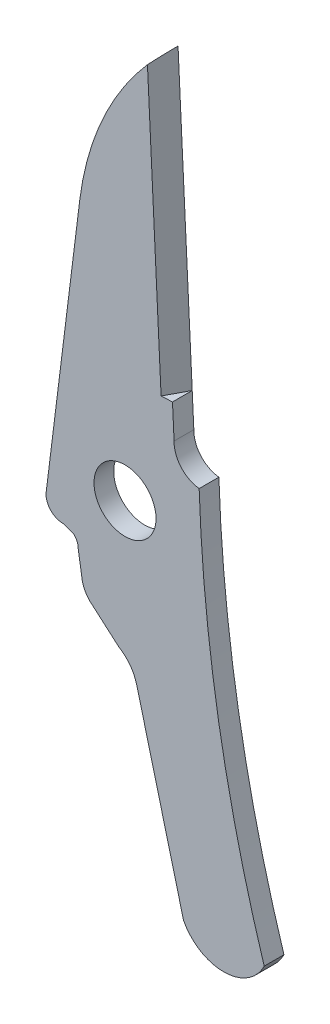
ISO-10303-21;
HEADER;
FILE_DESCRIPTION(('STEP AP214'),'2;1');
FILE_NAME('part.step','',(''),(''),'','','');
FILE_SCHEMA(('AUTOMOTIVE_DESIGN { 1 0 10303 214 1 1 1 1 }'));
ENDSEC;
DATA;
#1=APPLICATION_CONTEXT('core data for automotive mechanical design processes');
#2=APPLICATION_PROTOCOL_DEFINITION('international standard','automotive_design',2000,#1);
#3=PRODUCT_CONTEXT('',#1,'mechanical');
#4=PRODUCT('Part','Part','',(#3));
#5=PRODUCT_RELATED_PRODUCT_CATEGORY('part','',(#4));
#6=PRODUCT_DEFINITION_FORMATION('','',#4);
#7=PRODUCT_DEFINITION_CONTEXT('part definition',#1,'design');
#8=PRODUCT_DEFINITION('design','',#6,#7);
#9=PRODUCT_DEFINITION_SHAPE('','',#8);
#10=(LENGTH_UNIT() NAMED_UNIT(*) SI_UNIT(.MILLI.,.METRE.));
#11=(NAMED_UNIT(*) PLANE_ANGLE_UNIT() SI_UNIT($,.RADIAN.));
#12=(NAMED_UNIT(*) SI_UNIT($,.STERADIAN.) SOLID_ANGLE_UNIT());
#13=UNCERTAINTY_MEASURE_WITH_UNIT(LENGTH_MEASURE(1.E-05),#10,'distance_accuracy_value','');
#14=(GEOMETRIC_REPRESENTATION_CONTEXT(3) GLOBAL_UNCERTAINTY_ASSIGNED_CONTEXT((#13)) GLOBAL_UNIT_ASSIGNED_CONTEXT((#10,
#11,#12)) REPRESENTATION_CONTEXT('',''));
#15=CARTESIAN_POINT('',(0.,0.,0.));
#16=DIRECTION('',(0.,0.,1.));
#17=DIRECTION('',(1.,0.,0.));
#18=AXIS2_PLACEMENT_3D('',#15,#16,#17);
#19=CARTESIAN_POINT('',(9.00284972026528,22.726912505166,0.4445));
#20=DIRECTION('',(-0.998816471160994,-0.048638019465231,0.));
#21=DIRECTION('',(0.048638019465231,-0.998816471160993,0.));
#22=AXIS2_PLACEMENT_3D('',#19,#20,#21);
#23=PLANE('',#22);
#24=DIRECTION('',(0.,0.,-1.));
#25=VECTOR('',#24,1.);
#26=CARTESIAN_POINT('',(9.64159611899911,9.60979895973924,-0.4445));
#27=LINE('',#26,#25);
#28=CARTESIAN_POINT('',(9.64159611899911,9.60979895973925,0.4445));
#29=VERTEX_POINT('',#28);
#30=CARTESIAN_POINT('',(9.64159611899911,9.60979895973924,-0.4445));
#31=VERTEX_POINT('',#30);
#32=EDGE_CURVE('E331',#29,#31,#27,.T.);
#33=ORIENTED_EDGE('',*,*,#32,.F.);
#34=DIRECTION('',(-0.048638019465231,0.998816471160994,0.));
#35=VECTOR('',#34,1.);
#36=CARTESIAN_POINT('',(9.00284972026528,22.726912505166,0.4445));
#37=LINE('',#36,#35);
#38=CARTESIAN_POINT('',(9.71404972026528,8.12191250516599,0.4445));
#39=VERTEX_POINT('',#38);
#40=EDGE_CURVE('E180',#39,#29,#37,.T.);
#41=ORIENTED_EDGE('',*,*,#40,.F.);
#42=DIRECTION('',(0.,0.,-1.));
#43=VECTOR('',#42,1.);
#44=CARTESIAN_POINT('',(9.71404972026528,8.12191250516599,0.4445));
#45=LINE('',#44,#43);
#46=CARTESIAN_POINT('',(9.71404972026528,8.12191250516599,-0.4445));
#47=VERTEX_POINT('',#46);
#48=EDGE_CURVE('E186',#39,#47,#45,.T.);
#49=ORIENTED_EDGE('',*,*,#48,.T.);
#50=DIRECTION('',(-0.048638019465231,0.998816471160994,0.));
#51=VECTOR('',#50,1.);
#52=CARTESIAN_POINT('',(9.00284972026528,22.726912505166,-0.4445));
#53=LINE('',#52,#51);
#54=EDGE_CURVE('E226',#47,#31,#53,.T.);
#55=ORIENTED_EDGE('',*,*,#54,.T.);
#56=EDGE_LOOP('',(#33,#41,#49,#55));
#57=FACE_BOUND('',#56,.T.);
#58=ADVANCED_FACE('F38',(#57),#23,.F.);
#59=CARTESIAN_POINT('',(18.0703507512172,13.8347572515908,0.4445));
#60=DIRECTION('',(0.,0.,1.));
#61=DIRECTION('',(1.,0.,0.));
#62=AXIS2_PLACEMENT_3D('',#59,#60,#61);
#63=PLANE('',#62);
#64=DIRECTION('',(-0.048638019465231,0.998816471160993,0.));
#65=VECTOR('',#64,1.);
#66=CARTESIAN_POINT('',(9.12893919289632,9.58483479638119,0.4445));
#67=LINE('',#66,#65);
#68=CARTESIAN_POINT('',(9.12893919289632,9.58483479638119,0.4445));
#69=VERTEX_POINT('',#68);
#70=CARTESIAN_POINT('',(8.51463268443419,22.2000577380142,0.4445));
#71=VERTEX_POINT('',#70);
#72=EDGE_CURVE('E335',#69,#71,#67,.T.);
#73=ORIENTED_EDGE('',*,*,#72,.T.);
#74=CARTESIAN_POINT('',(18.0703507512172,13.8347572515908,0.4445));
#75=DIRECTION('',(0.,0.,1.));
#76=DIRECTION('',(1.,0.,0.));
#77=AXIS2_PLACEMENT_3D('',#74,#75,#76);
#78=CIRCLE('',#77,12.7);
#79=CARTESIAN_POINT('',(5.46767149406671,15.4039849410572,0.4445));
#80=VERTEX_POINT('',#79);
#81=EDGE_CURVE('E119',#71,#80,#78,.T.);
#82=ORIENTED_EDGE('',*,*,#81,.T.);
#83=DIRECTION('',(-0.123561235391059,-0.99233694938193,0.));
#84=VECTOR('',#83,1.);
#85=CARTESIAN_POINT('',(5.46767149406671,15.4039849410572,0.4445));
#86=LINE('',#85,#84);
#87=CARTESIAN_POINT('',(3.96223046287007,3.3135849410572,0.4445));
#88=VERTEX_POINT('',#87);
#89=EDGE_CURVE('E366',#80,#88,#86,.T.);
#90=ORIENTED_EDGE('',*,*,#89,.T.);
#91=CARTESIAN_POINT('',(4.70995075121722,3.16675725159075,0.4445));
#92=DIRECTION('',(0.,0.,1.));
#93=DIRECTION('',(1.,0.,0.));
#94=AXIS2_PLACEMENT_3D('',#91,#92,#93);
#95=CIRCLE('',#94,0.762);
#96=CARTESIAN_POINT('',(4.70995075121722,2.40475725159075,0.4445));
#97=VERTEX_POINT('',#96);
#98=EDGE_CURVE('E272',#88,#97,#95,.T.);
#99=ORIENTED_EDGE('',*,*,#98,.T.);
#100=DIRECTION('',(0.944320023055618,-0.329028409193243,0.));
#101=VECTOR('',#100,1.);
#102=CARTESIAN_POINT('',(4.70995075121722,2.40475725159075,0.4445));
#103=LINE('',#102,#101);
#104=CARTESIAN_POINT('',(5.19255075121722,2.23660545304808,0.4445));
#105=VERTEX_POINT('',#104);
#106=EDGE_CURVE('E293',#97,#105,#103,.T.);
#107=ORIENTED_EDGE('',*,*,#106,.T.);
#108=CARTESIAN_POINT('',(4.76075075121722,1.76975725159075,0.4445));
#109=DIRECTION('',(0.,0.,-1.));
#110=DIRECTION('',(-1.,0.,0.));
#111=AXIS2_PLACEMENT_3D('',#108,#109,#110);
#112=CIRCLE('',#111,0.635923331231008);
#113=CARTESIAN_POINT('',(5.39667408244823,1.76975725159075,0.4445));
#114=VERTEX_POINT('',#113);
#115=EDGE_CURVE('E289',#105,#114,#112,.T.);
#116=ORIENTED_EDGE('',*,*,#115,.T.);
#117=DIRECTION('',(0.155122482766874,-0.987895245124826,0.));
#118=VECTOR('',#117,1.);
#119=CARTESIAN_POINT('',(5.39667408244823,1.76975725159075,0.4445));
#120=LINE('',#119,#118);
#121=CARTESIAN_POINT('',(5.55222127450851,0.779157251590754,0.4445));
#122=VERTEX_POINT('',#121);
#123=EDGE_CURVE('E292',#114,#122,#120,.T.);
#124=ORIENTED_EDGE('',*,*,#123,.T.);
#125=CARTESIAN_POINT('',(6.81815075121722,0.880757251590754,0.4445));
#126=DIRECTION('',(0.,0.,1.));
#127=DIRECTION('',(1.,0.,0.));
#128=AXIS2_PLACEMENT_3D('',#125,#126,#127);
#129=CIRCLE('',#128,1.27);
#130=CARTESIAN_POINT('',(6.05075596195179,-0.13117418749406,0.4445));
#131=VERTEX_POINT('',#130);
#132=EDGE_CURVE('E298',#122,#131,#129,.T.);
#133=ORIENTED_EDGE('',*,*,#132,.T.);
#134=DIRECTION('',(0.754605522163505,-0.656178714924787,0.));
#135=VECTOR('',#134,1.);
#136=CARTESIAN_POINT('',(6.05075596195179,-0.13117418749406,0.4445));
#137=LINE('',#136,#135);
#138=CARTESIAN_POINT('',(7.21915596195179,-1.14717418749406,0.4445));
#139=VERTEX_POINT('',#138);
#140=EDGE_CURVE('E305',#131,#139,#137,.T.);
#141=ORIENTED_EDGE('',*,*,#140,.T.);
#142=CARTESIAN_POINT('',(6.31015075121722,-2.67524274840925,0.4445));
#143=DIRECTION('',(0.,0.,-1.));
#144=DIRECTION('',(1.,0.,0.));
#145=AXIS2_PLACEMENT_3D('',#142,#143,#144);
#146=CIRCLE('',#145,1.778);
#147=CARTESIAN_POINT('',(8.03118123931657,-2.22876983878032,0.4445));
#148=VERTEX_POINT('',#147);
#149=EDGE_CURVE('E308',#139,#148,#146,.T.);
#150=ORIENTED_EDGE('',*,*,#149,.T.);
#151=DIRECTION('',(0.251109622963401,-0.967958654724043,0.));
#152=VECTOR('',#151,1.);
#153=CARTESIAN_POINT('',(8.03118123931657,-2.22876983878032,0.4445));
#154=LINE('',#153,#152);
#155=CARTESIAN_POINT('',(10.1397620195859,-10.3567698387803,0.4445));
#156=VERTEX_POINT('',#155);
#157=EDGE_CURVE('E158',#148,#156,#154,.T.);
#158=ORIENTED_EDGE('',*,*,#157,.T.);
#159=CARTESIAN_POINT('',(11.9489507512172,-9.43164274840925,0.4445));
#160=DIRECTION('',(0.,0.,1.));
#161=DIRECTION('',(-1.,0.,0.));
#162=AXIS2_PLACEMENT_3D('',#159,#160,#161);
#163=CIRCLE('',#162,2.03200000000001);
#164=CARTESIAN_POINT('',(13.772182249136,-10.3287775794112,0.4445));
#165=VERTEX_POINT('',#164);
#166=EDGE_CURVE('E150',#156,#165,#163,.T.);
#167=ORIENTED_EDGE('',*,*,#166,.T.);
#168=CARTESIAN_POINT('',(75.3219507512172,9.00875725159075,0.4445));
#169=DIRECTION('',(0.,0.,-1.));
#170=DIRECTION('',(1.,0.,0.));
#171=AXIS2_PLACEMENT_3D('',#168,#169,#170);
#172=CIRCLE('',#171,64.516);
#173=CARTESIAN_POINT('',(10.842675562061,6.83221708861181,0.4445));
#174=VERTEX_POINT('',#173);
#175=EDGE_CURVE('E155',#165,#174,#172,.T.);
#176=ORIENTED_EDGE('',*,*,#175,.T.);
#177=CARTESIAN_POINT('',(10.9837507512172,8.09435725159075,0.4445));
#178=DIRECTION('',(0.,0.,-1.));
#179=DIRECTION('',(1.,0.,0.));
#180=AXIS2_PLACEMENT_3D('',#177,#178,#179);
#181=CIRCLE('',#180,1.27);
#182=EDGE_CURVE('E63',#174,#39,#181,.T.);
#183=ORIENTED_EDGE('',*,*,#182,.T.);
#184=ORIENTED_EDGE('',*,*,#40,.T.);
#185=DIRECTION('',(0.998816471160993,0.0486380194652366,0.));
#186=VECTOR('',#185,1.);
#187=CARTESIAN_POINT('',(9.64159611899911,9.60979895973924,0.4445));
#188=LINE('',#187,#186);
#189=EDGE_CURVE('E54',#69,#29,#188,.T.);
#190=ORIENTED_EDGE('',*,*,#189,.F.);
#191=EDGE_LOOP('',(#73,#82,#90,#99,#107,#116,#124,#133,#141,#150,#158,#167,#176,#183,#184,#190));
#192=FACE_BOUND('',#191,.T.);
#193=CARTESIAN_POINT('',(7.50395075121722,4.69075725159075,0.4445));
#194=DIRECTION('',(0.,0.,1.));
#195=DIRECTION('',(1.,0.,0.));
#196=AXIS2_PLACEMENT_3D('',#193,#194,#195);
#197=CIRCLE('',#196,1.397);
#198=CARTESIAN_POINT('',(8.90095075121722,4.69075725159075,0.4445));
#199=VERTEX_POINT('',#198);
#200=EDGE_CURVE('E192',#199,#199,#197,.T.);
#201=ORIENTED_EDGE('',*,*,#200,.F.);
#202=EDGE_LOOP('',(#201));
#203=FACE_BOUND('',#202,.T.);
#204=ADVANCED_FACE('F152',(#192,#203),#63,.T.);
#205=CARTESIAN_POINT('',(18.0703507512172,13.8347572515908,-0.4445));
#206=DIRECTION('',(0.,0.,1.));
#207=DIRECTION('',(1.,0.,0.));
#208=AXIS2_PLACEMENT_3D('',#205,#206,#207);
#209=PLANE('',#208);
#210=CARTESIAN_POINT('',(18.0703507512172,13.8347572515908,-0.4445));
#211=DIRECTION('',(0.,0.,1.));
#212=DIRECTION('',(1.,0.,0.));
#213=AXIS2_PLACEMENT_3D('',#210,#211,#212);
#214=CIRCLE('',#213,12.7);
#215=CARTESIAN_POINT('',(9.00284972026528,22.726912505166,-0.4445));
#216=VERTEX_POINT('',#215);
#217=CARTESIAN_POINT('',(5.46767149406671,15.4039849410572,-0.4445));
#218=VERTEX_POINT('',#217);
#219=EDGE_CURVE('E187',#216,#218,#214,.T.);
#220=ORIENTED_EDGE('',*,*,#219,.F.);
#221=DIRECTION('',(-0.048638019465231,0.998816471160993,0.));
#222=VECTOR('',#221,1.);
#223=CARTESIAN_POINT('',(9.64159611899911,9.60979895973924,-0.4445));
#224=LINE('',#223,#222);
#225=EDGE_CURVE('E347',#31,#216,#224,.T.);
#226=ORIENTED_EDGE('',*,*,#225,.F.);
#227=ORIENTED_EDGE('',*,*,#54,.F.);
#228=CARTESIAN_POINT('',(10.9837507512172,8.09435725159075,-0.4445));
#229=DIRECTION('',(0.,0.,-1.));
#230=DIRECTION('',(1.,0.,0.));
#231=AXIS2_PLACEMENT_3D('',#228,#229,#230);
#232=CIRCLE('',#231,1.27);
#233=CARTESIAN_POINT('',(10.842675562061,6.83221708861181,-0.4445));
#234=VERTEX_POINT('',#233);
#235=EDGE_CURVE('E111',#234,#47,#232,.T.);
#236=ORIENTED_EDGE('',*,*,#235,.F.);
#237=CARTESIAN_POINT('',(75.3219507512172,9.00875725159075,-0.4445));
#238=DIRECTION('',(0.,0.,-1.));
#239=DIRECTION('',(1.,0.,0.));
#240=AXIS2_PLACEMENT_3D('',#237,#238,#239);
#241=CIRCLE('',#240,64.516);
#242=CARTESIAN_POINT('',(13.772182249136,-10.3287775794112,-0.4445));
#243=VERTEX_POINT('',#242);
#244=EDGE_CURVE('E221',#243,#234,#241,.T.);
#245=ORIENTED_EDGE('',*,*,#244,.F.);
#246=CARTESIAN_POINT('',(11.9489507512172,-9.43164274840925,-0.4445));
#247=DIRECTION('',(0.,0.,1.));
#248=DIRECTION('',(-1.,0.,0.));
#249=AXIS2_PLACEMENT_3D('',#246,#247,#248);
#250=CIRCLE('',#249,2.03200000000001);
#251=CARTESIAN_POINT('',(10.1397620195859,-10.3567698387803,-0.4445));
#252=VERTEX_POINT('',#251);
#253=EDGE_CURVE('E168',#252,#243,#250,.T.);
#254=ORIENTED_EDGE('',*,*,#253,.F.);
#255=DIRECTION('',(0.251109622963401,-0.967958654724043,0.));
#256=VECTOR('',#255,1.);
#257=CARTESIAN_POINT('',(8.03118123931657,-2.22876983878032,-0.4445));
#258=LINE('',#257,#256);
#259=CARTESIAN_POINT('',(8.03118123931657,-2.22876983878032,-0.4445));
#260=VERTEX_POINT('',#259);
#261=EDGE_CURVE('E216',#260,#252,#258,.T.);
#262=ORIENTED_EDGE('',*,*,#261,.F.);
#263=CARTESIAN_POINT('',(6.31015075121722,-2.67524274840925,-0.4445));
#264=DIRECTION('',(0.,0.,-1.));
#265=DIRECTION('',(1.,0.,0.));
#266=AXIS2_PLACEMENT_3D('',#263,#264,#265);
#267=CIRCLE('',#266,1.778);
#268=CARTESIAN_POINT('',(7.21915596195179,-1.14717418749406,-0.4445));
#269=VERTEX_POINT('',#268);
#270=EDGE_CURVE('E213',#269,#260,#267,.T.);
#271=ORIENTED_EDGE('',*,*,#270,.F.);
#272=DIRECTION('',(0.754605522163505,-0.656178714924787,0.));
#273=VECTOR('',#272,1.);
#274=CARTESIAN_POINT('',(6.05075596195179,-0.13117418749406,-0.4445));
#275=LINE('',#274,#273);
#276=CARTESIAN_POINT('',(6.05075596195179,-0.13117418749406,-0.4445));
#277=VERTEX_POINT('',#276);
#278=EDGE_CURVE('E210',#277,#269,#275,.T.);
#279=ORIENTED_EDGE('',*,*,#278,.F.);
#280=CARTESIAN_POINT('',(6.81815075121722,0.880757251590754,-0.4445));
#281=DIRECTION('',(0.,0.,1.));
#282=DIRECTION('',(1.,0.,0.));
#283=AXIS2_PLACEMENT_3D('',#280,#281,#282);
#284=CIRCLE('',#283,1.27);
#285=CARTESIAN_POINT('',(5.55222127450851,0.779157251590754,-0.4445));
#286=VERTEX_POINT('',#285);
#287=EDGE_CURVE('E207',#286,#277,#284,.T.);
#288=ORIENTED_EDGE('',*,*,#287,.F.);
#289=DIRECTION('',(0.155122482766874,-0.987895245124826,0.));
#290=VECTOR('',#289,1.);
#291=CARTESIAN_POINT('',(5.39667408244823,1.76975725159075,-0.4445));
#292=LINE('',#291,#290);
#293=CARTESIAN_POINT('',(5.39667408244823,1.76975725159075,-0.4445));
#294=VERTEX_POINT('',#293);
#295=EDGE_CURVE('E204',#294,#286,#292,.T.);
#296=ORIENTED_EDGE('',*,*,#295,.F.);
#297=CARTESIAN_POINT('',(4.76075075121722,1.76975725159075,-0.4445));
#298=DIRECTION('',(0.,0.,-1.));
#299=DIRECTION('',(-1.,0.,0.));
#300=AXIS2_PLACEMENT_3D('',#297,#298,#299);
#301=CIRCLE('',#300,0.635923331231008);
#302=CARTESIAN_POINT('',(5.19255075121722,2.23660545304808,-0.4445));
#303=VERTEX_POINT('',#302);
#304=EDGE_CURVE('E201',#303,#294,#301,.T.);
#305=ORIENTED_EDGE('',*,*,#304,.F.);
#306=DIRECTION('',(0.944320023055618,-0.329028409193243,0.));
#307=VECTOR('',#306,1.);
#308=CARTESIAN_POINT('',(4.70995075121722,2.40475725159075,-0.4445));
#309=LINE('',#308,#307);
#310=CARTESIAN_POINT('',(4.70995075121722,2.40475725159075,-0.4445));
#311=VERTEX_POINT('',#310);
#312=EDGE_CURVE('E198',#311,#303,#309,.T.);
#313=ORIENTED_EDGE('',*,*,#312,.F.);
#314=CARTESIAN_POINT('',(4.70995075121722,3.16675725159075,-0.4445));
#315=DIRECTION('',(0.,0.,1.));
#316=DIRECTION('',(1.,0.,0.));
#317=AXIS2_PLACEMENT_3D('',#314,#315,#316);
#318=CIRCLE('',#317,0.762);
#319=CARTESIAN_POINT('',(3.96223046287007,3.3135849410572,-0.4445));
#320=VERTEX_POINT('',#319);
#321=EDGE_CURVE('E195',#320,#311,#318,.T.);
#322=ORIENTED_EDGE('',*,*,#321,.F.);
#323=DIRECTION('',(-0.123561235391059,-0.99233694938193,0.));
#324=VECTOR('',#323,1.);
#325=CARTESIAN_POINT('',(5.46767149406671,15.4039849410572,-0.4445));
#326=LINE('',#325,#324);
#327=EDGE_CURVE('E191',#218,#320,#326,.T.);
#328=ORIENTED_EDGE('',*,*,#327,.F.);
#329=EDGE_LOOP('',(#220,#226,#227,#236,#245,#254,#262,#271,#279,#288,#296,#305,#313,#322,#328));
#330=FACE_BOUND('',#329,.T.);
#331=CARTESIAN_POINT('',(7.50395075121722,4.69075725159075,-0.4445));
#332=DIRECTION('',(0.,0.,1.));
#333=DIRECTION('',(1.,0.,0.));
#334=AXIS2_PLACEMENT_3D('',#331,#332,#333);
#335=CIRCLE('',#334,1.397);
#336=CARTESIAN_POINT('',(8.90095075121722,4.69075725159075,-0.4445));
#337=VERTEX_POINT('',#336);
#338=EDGE_CURVE('E357',#337,#337,#335,.T.);
#339=ORIENTED_EDGE('',*,*,#338,.T.);
#340=EDGE_LOOP('',(#339));
#341=FACE_BOUND('',#340,.T.);
#342=ADVANCED_FACE('F277',(#330,#341),#209,.F.);
#343=CARTESIAN_POINT('',(18.0703507512172,13.8347572515908,0.4445));
#344=DIRECTION('',(0.,0.,-1.));
#345=DIRECTION('',(-1.,0.,0.));
#346=AXIS2_PLACEMENT_3D('',#343,#344,#345);
#347=CYLINDRICAL_SURFACE('',#346,12.7);
#348=ORIENTED_EDGE('',*,*,#81,.F.);
#349=CARTESIAN_POINT('',(18.0703507512172,13.8347572515908,-15.3821782551398));
#350=DIRECTION('',(-0.865000437743751,-0.0421217604466522,-0.499999999999995));
#351=DIRECTION('',(0.499408235580491,0.0243190097326152,-0.866025403784442));
#352=AXIS2_PLACEMENT_3D('',#349,#350,#351);
#353=ELLIPSE('',#352,25.4000000000003,12.7);
#354=EDGE_CURVE('E351',#71,#216,#353,.T.);
#355=ORIENTED_EDGE('',*,*,#354,.T.);
#356=ORIENTED_EDGE('',*,*,#219,.T.);
#357=DIRECTION('',(0.,0.,-1.));
#358=VECTOR('',#357,1.);
#359=CARTESIAN_POINT('',(5.46767149406671,15.4039849410572,0.4445));
#360=LINE('',#359,#358);
#361=EDGE_CURVE('E11',#80,#218,#360,.T.);
#362=ORIENTED_EDGE('',*,*,#361,.F.);
#363=EDGE_LOOP('',(#348,#355,#356,#362));
#364=FACE_BOUND('',#363,.T.);
#365=ADVANCED_FACE('F40',(#364),#347,.T.);
#366=CARTESIAN_POINT('',(5.46767149406671,15.4039849410572,0.4445));
#367=DIRECTION('',(0.99233694938193,-0.123561235391059,0.));
#368=DIRECTION('',(0.123561235391059,0.99233694938193,0.));
#369=AXIS2_PLACEMENT_3D('',#366,#367,#368);
#370=PLANE('',#369);
#371=ORIENTED_EDGE('',*,*,#327,.T.);
#372=DIRECTION('',(0.,0.,-1.));
#373=VECTOR('',#372,1.);
#374=CARTESIAN_POINT('',(3.96223046287007,3.3135849410572,0.4445));
#375=LINE('',#374,#373);
#376=EDGE_CURVE('E47',#88,#320,#375,.T.);
#377=ORIENTED_EDGE('',*,*,#376,.F.);
#378=ORIENTED_EDGE('',*,*,#89,.F.);
#379=ORIENTED_EDGE('',*,*,#361,.T.);
#380=EDGE_LOOP('',(#371,#377,#378,#379));
#381=FACE_BOUND('',#380,.T.);
#382=ADVANCED_FACE('F371',(#381),#370,.F.);
#383=CARTESIAN_POINT('',(4.70995075121722,3.16675725159075,0.4445));
#384=DIRECTION('',(0.,0.,-1.));
#385=DIRECTION('',(-1.,0.,0.));
#386=AXIS2_PLACEMENT_3D('',#383,#384,#385);
#387=CYLINDRICAL_SURFACE('',#386,0.762);
#388=ORIENTED_EDGE('',*,*,#321,.T.);
#389=DIRECTION('',(0.,0.,-1.));
#390=VECTOR('',#389,1.);
#391=CARTESIAN_POINT('',(4.70995075121722,2.40475725159075,0.4445));
#392=LINE('',#391,#390);
#393=EDGE_CURVE('E260',#97,#311,#392,.T.);
#394=ORIENTED_EDGE('',*,*,#393,.F.);
#395=ORIENTED_EDGE('',*,*,#98,.F.);
#396=ORIENTED_EDGE('',*,*,#376,.T.);
#397=EDGE_LOOP('',(#388,#394,#395,#396));
#398=FACE_BOUND('',#397,.T.);
#399=ADVANCED_FACE('F270',(#398),#387,.T.);
#400=CARTESIAN_POINT('',(4.70995075121722,2.40475725159075,0.4445));
#401=DIRECTION('',(0.329028409193243,0.944320023055618,0.));
#402=DIRECTION('',(-0.944320023055618,0.329028409193243,0.));
#403=AXIS2_PLACEMENT_3D('',#400,#401,#402);
#404=PLANE('',#403);
#405=ORIENTED_EDGE('',*,*,#312,.T.);
#406=DIRECTION('',(0.,0.,-1.));
#407=VECTOR('',#406,1.);
#408=CARTESIAN_POINT('',(5.19255075121722,2.23660545304808,0.4445));
#409=LINE('',#408,#407);
#410=EDGE_CURVE('E256',#105,#303,#409,.T.);
#411=ORIENTED_EDGE('',*,*,#410,.F.);
#412=ORIENTED_EDGE('',*,*,#106,.F.);
#413=ORIENTED_EDGE('',*,*,#393,.T.);
#414=EDGE_LOOP('',(#405,#411,#412,#413));
#415=FACE_BOUND('',#414,.T.);
#416=ADVANCED_FACE('F283',(#415),#404,.F.);
#417=CARTESIAN_POINT('',(4.76075075121722,1.76975725159075,0.4445));
#418=DIRECTION('',(0.,0.,-1.));
#419=DIRECTION('',(-1.,0.,0.));
#420=AXIS2_PLACEMENT_3D('',#417,#418,#419);
#421=CYLINDRICAL_SURFACE('',#420,0.635923331231008);
#422=ORIENTED_EDGE('',*,*,#304,.T.);
#423=DIRECTION('',(0.,0.,-1.));
#424=VECTOR('',#423,1.);
#425=CARTESIAN_POINT('',(5.39667408244823,1.76975725159075,0.4445));
#426=LINE('',#425,#424);
#427=EDGE_CURVE('E252',#114,#294,#426,.T.);
#428=ORIENTED_EDGE('',*,*,#427,.F.);
#429=ORIENTED_EDGE('',*,*,#115,.F.);
#430=ORIENTED_EDGE('',*,*,#410,.T.);
#431=EDGE_LOOP('',(#422,#428,#429,#430));
#432=FACE_BOUND('',#431,.T.);
#433=ADVANCED_FACE('F287',(#432),#421,.F.);
#434=CARTESIAN_POINT('',(5.39667408244823,1.76975725159075,0.4445));
#435=DIRECTION('',(0.987895245124826,0.155122482766874,0.));
#436=DIRECTION('',(-0.155122482766874,0.987895245124827,0.));
#437=AXIS2_PLACEMENT_3D('',#434,#435,#436);
#438=PLANE('',#437);
#439=ORIENTED_EDGE('',*,*,#295,.T.);
#440=DIRECTION('',(0.,0.,-1.));
#441=VECTOR('',#440,1.);
#442=CARTESIAN_POINT('',(5.55222127450851,0.779157251590754,0.4445));
#443=LINE('',#442,#441);
#444=EDGE_CURVE('E248',#122,#286,#443,.T.);
#445=ORIENTED_EDGE('',*,*,#444,.F.);
#446=ORIENTED_EDGE('',*,*,#123,.F.);
#447=ORIENTED_EDGE('',*,*,#427,.T.);
#448=EDGE_LOOP('',(#439,#445,#446,#447));
#449=FACE_BOUND('',#448,.T.);
#450=ADVANCED_FACE('F412',(#449),#438,.F.);
#451=CARTESIAN_POINT('',(6.81815075121722,0.880757251590754,0.4445));
#452=DIRECTION('',(0.,0.,-1.));
#453=DIRECTION('',(-1.,0.,0.));
#454=AXIS2_PLACEMENT_3D('',#451,#452,#453);
#455=CYLINDRICAL_SURFACE('',#454,1.27);
#456=ORIENTED_EDGE('',*,*,#287,.T.);
#457=DIRECTION('',(0.,0.,-1.));
#458=VECTOR('',#457,1.);
#459=CARTESIAN_POINT('',(6.05075596195179,-0.13117418749406,0.4445));
#460=LINE('',#459,#458);
#461=EDGE_CURVE('E244',#131,#277,#460,.T.);
#462=ORIENTED_EDGE('',*,*,#461,.F.);
#463=ORIENTED_EDGE('',*,*,#132,.F.);
#464=ORIENTED_EDGE('',*,*,#444,.T.);
#465=EDGE_LOOP('',(#456,#462,#463,#464));
#466=FACE_BOUND('',#465,.T.);
#467=ADVANCED_FACE('F408',(#466),#455,.T.);
#468=CARTESIAN_POINT('',(6.05075596195179,-0.13117418749406,0.4445));
#469=DIRECTION('',(0.656178714924787,0.754605522163505,0.));
#470=DIRECTION('',(-0.754605522163505,0.656178714924787,0.));
#471=AXIS2_PLACEMENT_3D('',#468,#469,#470);
#472=PLANE('',#471);
#473=ORIENTED_EDGE('',*,*,#278,.T.);
#474=DIRECTION('',(0.,0.,-1.));
#475=VECTOR('',#474,1.);
#476=CARTESIAN_POINT('',(7.21915596195179,-1.14717418749406,0.4445));
#477=LINE('',#476,#475);
#478=EDGE_CURVE('E240',#139,#269,#477,.T.);
#479=ORIENTED_EDGE('',*,*,#478,.F.);
#480=ORIENTED_EDGE('',*,*,#140,.F.);
#481=ORIENTED_EDGE('',*,*,#461,.T.);
#482=EDGE_LOOP('',(#473,#479,#480,#481));
#483=FACE_BOUND('',#482,.T.);
#484=ADVANCED_FACE('F405',(#483),#472,.F.);
#485=CARTESIAN_POINT('',(6.31015075121722,-2.67524274840925,0.4445));
#486=DIRECTION('',(0.,0.,-1.));
#487=DIRECTION('',(-1.,0.,0.));
#488=AXIS2_PLACEMENT_3D('',#485,#486,#487);
#489=CYLINDRICAL_SURFACE('',#488,1.778);
#490=ORIENTED_EDGE('',*,*,#270,.T.);
#491=DIRECTION('',(0.,0.,-1.));
#492=VECTOR('',#491,1.);
#493=CARTESIAN_POINT('',(8.03118123931657,-2.22876983878032,0.4445));
#494=LINE('',#493,#492);
#495=EDGE_CURVE('E236',#148,#260,#494,.T.);
#496=ORIENTED_EDGE('',*,*,#495,.F.);
#497=ORIENTED_EDGE('',*,*,#149,.F.);
#498=ORIENTED_EDGE('',*,*,#478,.T.);
#499=EDGE_LOOP('',(#490,#496,#497,#498));
#500=FACE_BOUND('',#499,.T.);
#501=ADVANCED_FACE('F322',(#500),#489,.F.);
#502=CARTESIAN_POINT('',(8.03118123931657,-2.22876983878032,0.4445));
#503=DIRECTION('',(0.967958654724043,0.251109622963401,0.));
#504=DIRECTION('',(-0.251109622963401,0.967958654724043,0.));
#505=AXIS2_PLACEMENT_3D('',#502,#503,#504);
#506=PLANE('',#505);
#507=ORIENTED_EDGE('',*,*,#261,.T.);
#508=DIRECTION('',(0.,0.,-1.));
#509=VECTOR('',#508,1.);
#510=CARTESIAN_POINT('',(10.1397620195859,-10.3567698387803,0.4445));
#511=LINE('',#510,#509);
#512=EDGE_CURVE('E172',#156,#252,#511,.T.);
#513=ORIENTED_EDGE('',*,*,#512,.F.);
#514=ORIENTED_EDGE('',*,*,#157,.F.);
#515=ORIENTED_EDGE('',*,*,#495,.T.);
#516=EDGE_LOOP('',(#507,#513,#514,#515));
#517=FACE_BOUND('',#516,.T.);
#518=ADVANCED_FACE('F326',(#517),#506,.F.);
#519=CARTESIAN_POINT('',(11.9489507512172,-9.43164274840925,0.4445));
#520=DIRECTION('',(0.,0.,-1.));
#521=DIRECTION('',(-1.,0.,0.));
#522=AXIS2_PLACEMENT_3D('',#519,#520,#521);
#523=CYLINDRICAL_SURFACE('',#522,2.03200000000001);
#524=ORIENTED_EDGE('',*,*,#253,.T.);
#525=DIRECTION('',(0.,0.,-1.));
#526=VECTOR('',#525,1.);
#527=CARTESIAN_POINT('',(13.772182249136,-10.3287775794112,0.4445));
#528=LINE('',#527,#526);
#529=EDGE_CURVE('E165',#165,#243,#528,.T.);
#530=ORIENTED_EDGE('',*,*,#529,.F.);
#531=ORIENTED_EDGE('',*,*,#166,.F.);
#532=ORIENTED_EDGE('',*,*,#512,.T.);
#533=EDGE_LOOP('',(#524,#530,#531,#532));
#534=FACE_BOUND('',#533,.T.);
#535=ADVANCED_FACE('F166',(#534),#523,.T.);
#536=CARTESIAN_POINT('',(75.3219507512172,9.00875725159075,0.4445));
#537=DIRECTION('',(0.,0.,-1.));
#538=DIRECTION('',(-1.,0.,0.));
#539=AXIS2_PLACEMENT_3D('',#536,#537,#538);
#540=CYLINDRICAL_SURFACE('',#539,64.516);
#541=ORIENTED_EDGE('',*,*,#244,.T.);
#542=DIRECTION('',(0.,0.,-1.));
#543=VECTOR('',#542,1.);
#544=CARTESIAN_POINT('',(10.842675562061,6.83221708861181,0.4445));
#545=LINE('',#544,#543);
#546=EDGE_CURVE('E173',#174,#234,#545,.T.);
#547=ORIENTED_EDGE('',*,*,#546,.F.);
#548=ORIENTED_EDGE('',*,*,#175,.F.);
#549=ORIENTED_EDGE('',*,*,#529,.T.);
#550=EDGE_LOOP('',(#541,#547,#548,#549));
#551=FACE_BOUND('',#550,.T.);
#552=ADVANCED_FACE('F175',(#551),#540,.F.);
#553=CARTESIAN_POINT('',(10.9837507512172,8.09435725159075,0.4445));
#554=DIRECTION('',(0.,0.,-1.));
#555=DIRECTION('',(-1.,0.,0.));
#556=AXIS2_PLACEMENT_3D('',#553,#554,#555);
#557=CYLINDRICAL_SURFACE('',#556,1.27);
#558=ORIENTED_EDGE('',*,*,#235,.T.);
#559=ORIENTED_EDGE('',*,*,#48,.F.);
#560=ORIENTED_EDGE('',*,*,#182,.F.);
#561=ORIENTED_EDGE('',*,*,#546,.T.);
#562=EDGE_LOOP('',(#558,#559,#560,#561));
#563=FACE_BOUND('',#562,.T.);
#564=ADVANCED_FACE('F328',(#563),#557,.F.);
#565=CARTESIAN_POINT('',(7.50395075121722,4.69075725159075,0.4445));
#566=DIRECTION('',(0.,0.,-1.));
#567=DIRECTION('',(-1.,0.,0.));
#568=AXIS2_PLACEMENT_3D('',#565,#566,#567);
#569=CYLINDRICAL_SURFACE('',#568,1.397);
#570=ORIENTED_EDGE('',*,*,#200,.T.);
#571=EDGE_LOOP('',(#570));
#572=FACE_BOUND('',#571,.T.);
#573=ORIENTED_EDGE('',*,*,#338,.F.);
#574=EDGE_LOOP('',(#573));
#575=FACE_BOUND('',#574,.T.);
#576=ADVANCED_FACE('F385',(#572,#575),#569,.F.);
#577=CARTESIAN_POINT('',(9.12893919289632,9.58483479638119,0.4445));
#578=DIRECTION('',(-0.865000437743751,-0.0421217604466522,-0.499999999999995));
#579=DIRECTION('',(-0.50044415178804,0.,0.865768820725919));
#580=AXIS2_PLACEMENT_3D('',#577,#578,#579);
#581=PLANE('',#580);
#582=ORIENTED_EDGE('',*,*,#72,.F.);
#583=DIRECTION('',(-0.499408235580491,-0.024319009732618,0.866025403784442));
#584=VECTOR('',#583,1.);
#585=CARTESIAN_POINT('',(9.12893919289632,9.58483479638119,0.4445));
#586=LINE('',#585,#584);
#587=EDGE_CURVE('E339',#31,#69,#586,.T.);
#588=ORIENTED_EDGE('',*,*,#587,.F.);
#589=ORIENTED_EDGE('',*,*,#225,.T.);
#590=ORIENTED_EDGE('',*,*,#354,.F.);
#591=EDGE_LOOP('',(#582,#588,#589,#590));
#592=FACE_BOUND('',#591,.T.);
#593=ADVANCED_FACE('F378',(#592),#581,.F.);
#594=CARTESIAN_POINT('',(-0.444039696853595,9.11867234609767,0.));
#595=DIRECTION('',(-0.0486380194652366,0.998816471160993,0.));
#596=DIRECTION('',(-0.998816471160993,-0.0486380194652366,0.));
#597=AXIS2_PLACEMENT_3D('',#594,#595,#596);
#598=PLANE('',#597);
#599=ORIENTED_EDGE('',*,*,#587,.T.);
#600=ORIENTED_EDGE('',*,*,#189,.T.);
#601=ORIENTED_EDGE('',*,*,#32,.T.);
#602=EDGE_LOOP('',(#599,#600,#601));
#603=FACE_BOUND('',#602,.T.);
#604=ADVANCED_FACE('F379',(#603),#598,.T.);
#605=CLOSED_SHELL('',(#58,#204,#342,#365,#382,#399,#416,#433,#450,#467,#484,#501,#518,#535,#552,
#564,#576,#593,#604));
#606=MANIFOLD_SOLID_BREP('B2',#605);
#607=ADVANCED_BREP_SHAPE_REPRESENTATION('',(#18,#606),#14);
#608=SHAPE_DEFINITION_REPRESENTATION(#9,#607);
ENDSEC;
END-ISO-10303-21;
